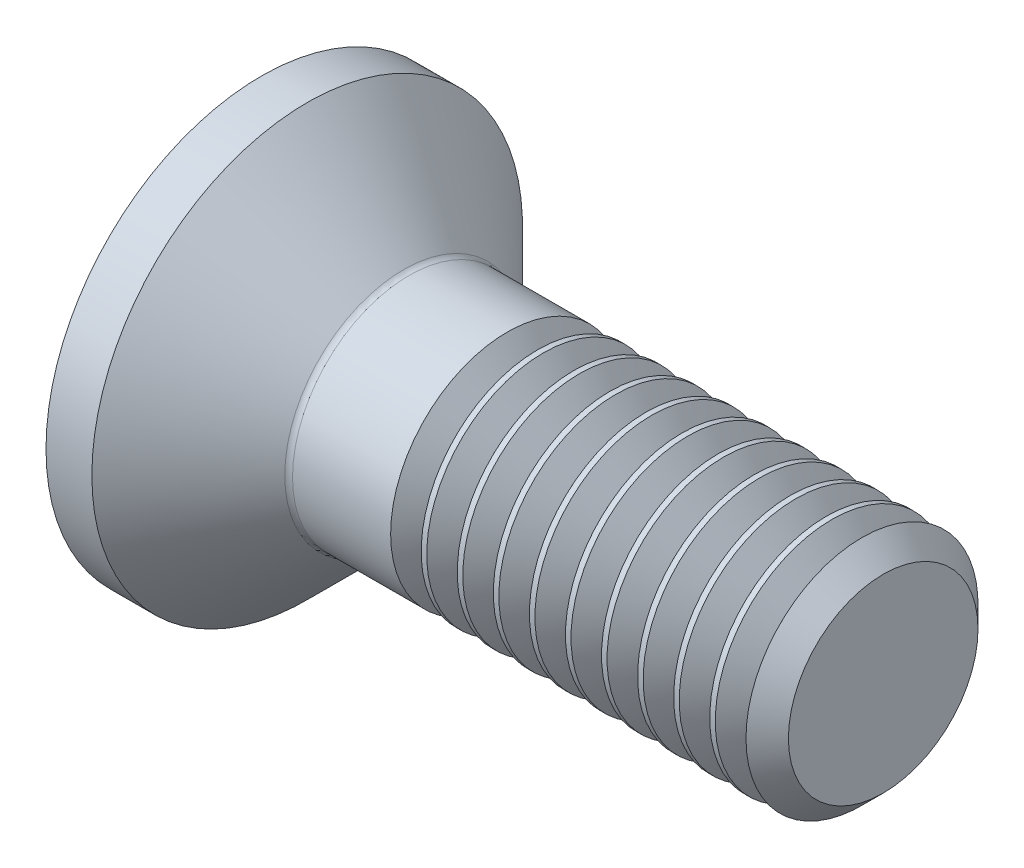
ISO-10303-21;
HEADER;
FILE_DESCRIPTION(('STEP AP214'),'2;1');
FILE_NAME('part.step','',(''),(''),'','','');
FILE_SCHEMA(('AUTOMOTIVE_DESIGN { 1 0 10303 214 1 1 1 1 }'));
ENDSEC;
DATA;
#1=APPLICATION_CONTEXT('core data for automotive mechanical design processes');
#2=APPLICATION_PROTOCOL_DEFINITION('international standard','automotive_design',2000,#1);
#3=PRODUCT_CONTEXT('',#1,'mechanical');
#4=PRODUCT('Part','Part','',(#3));
#5=PRODUCT_RELATED_PRODUCT_CATEGORY('part','',(#4));
#6=PRODUCT_DEFINITION_FORMATION('','',#4);
#7=PRODUCT_DEFINITION_CONTEXT('part definition',#1,'design');
#8=PRODUCT_DEFINITION('design','',#6,#7);
#9=PRODUCT_DEFINITION_SHAPE('','',#8);
#10=(LENGTH_UNIT() NAMED_UNIT(*) SI_UNIT(.MILLI.,.METRE.));
#11=(NAMED_UNIT(*) PLANE_ANGLE_UNIT() SI_UNIT($,.RADIAN.));
#12=(NAMED_UNIT(*) SI_UNIT($,.STERADIAN.) SOLID_ANGLE_UNIT());
#13=UNCERTAINTY_MEASURE_WITH_UNIT(LENGTH_MEASURE(1.E-05),#10,'distance_accuracy_value','');
#14=(GEOMETRIC_REPRESENTATION_CONTEXT(3) GLOBAL_UNCERTAINTY_ASSIGNED_CONTEXT((#13)) GLOBAL_UNIT_ASSIGNED_CONTEXT((#10,
#11,#12)) REPRESENTATION_CONTEXT('',''));
#15=CARTESIAN_POINT('',(0.,0.,0.));
#16=DIRECTION('',(0.,0.,1.));
#17=DIRECTION('',(1.,0.,0.));
#18=AXIS2_PLACEMENT_3D('',#15,#16,#17);
#19=CARTESIAN_POINT('',(0.,0.,0.));
#20=DIRECTION('',(-1.,0.,0.));
#21=DIRECTION('',(0.,0.,1.));
#22=AXIS2_PLACEMENT_3D('',#19,#20,#21);
#23=PLANE('',#22);
#24=CARTESIAN_POINT('',(0.,0.,0.));
#25=DIRECTION('',(-1.,0.,0.));
#26=DIRECTION('',(0.,0.,1.));
#27=AXIS2_PLACEMENT_3D('',#24,#25,#26);
#28=CIRCLE('',#27,2.77);
#29=CARTESIAN_POINT('',(0.,0.,2.77));
#30=VERTEX_POINT('',#29);
#31=EDGE_CURVE('E152',#30,#30,#28,.T.);
#32=ORIENTED_EDGE('',*,*,#31,.T.);
#33=EDGE_LOOP('',(#32));
#34=FACE_BOUND('',#33,.T.);
#35=DIRECTION('',(0.,-0.499999999999998,-0.86602540378444));
#36=VECTOR('',#35,1.);
#37=CARTESIAN_POINT('',(0.,-0.577350269189626,1.));
#38=LINE('',#37,#36);
#39=CARTESIAN_POINT('',(0.,-0.577350269189626,1.));
#40=VERTEX_POINT('',#39);
#41=CARTESIAN_POINT('',(0.,-1.15470053837925,0.));
#42=VERTEX_POINT('',#41);
#43=EDGE_CURVE('E121',#40,#42,#38,.T.);
#44=ORIENTED_EDGE('',*,*,#43,.T.);
#45=DIRECTION('',(0.,0.499999999999999,-0.866025403784439));
#46=VECTOR('',#45,1.);
#47=CARTESIAN_POINT('',(0.,-1.15470053837925,0.));
#48=LINE('',#47,#46);
#49=CARTESIAN_POINT('',(0.,-0.577350269189625,-1.));
#50=VERTEX_POINT('',#49);
#51=EDGE_CURVE('E52',#42,#50,#48,.T.);
#52=ORIENTED_EDGE('',*,*,#51,.T.);
#53=DIRECTION('',(0.,1.,0.));
#54=VECTOR('',#53,1.);
#55=CARTESIAN_POINT('',(0.,-0.577350269189625,-1.));
#56=LINE('',#55,#54);
#57=CARTESIAN_POINT('',(0.,0.577350269189626,-1.));
#58=VERTEX_POINT('',#57);
#59=EDGE_CURVE('E132',#50,#58,#56,.T.);
#60=ORIENTED_EDGE('',*,*,#59,.T.);
#61=DIRECTION('',(0.,0.5,0.866025403784439));
#62=VECTOR('',#61,1.);
#63=CARTESIAN_POINT('',(0.,0.577350269189626,-1.));
#64=LINE('',#63,#62);
#65=CARTESIAN_POINT('',(0.,1.15470053837925,0.));
#66=VERTEX_POINT('',#65);
#67=EDGE_CURVE('E417',#58,#66,#64,.T.);
#68=ORIENTED_EDGE('',*,*,#67,.T.);
#69=DIRECTION('',(0.,-0.499999999999999,0.866025403784439));
#70=VECTOR('',#69,1.);
#71=CARTESIAN_POINT('',(0.,1.15470053837925,0.));
#72=LINE('',#71,#70);
#73=CARTESIAN_POINT('',(0.,0.577350269189626,0.999999999999999));
#74=VERTEX_POINT('',#73);
#75=EDGE_CURVE('E420',#66,#74,#72,.T.);
#76=ORIENTED_EDGE('',*,*,#75,.T.);
#77=DIRECTION('',(0.,-1.,0.));
#78=VECTOR('',#77,1.);
#79=CARTESIAN_POINT('',(0.,0.577350269189626,0.999999999999999));
#80=LINE('',#79,#78);
#81=EDGE_CURVE('E423',#74,#40,#80,.T.);
#82=ORIENTED_EDGE('',*,*,#81,.T.);
#83=EDGE_LOOP('',(#44,#52,#60,#68,#76,#82));
#84=FACE_BOUND('',#83,.T.);
#85=ADVANCED_FACE('F36',(#34,#84),#23,.T.);
#86=CARTESIAN_POINT('',(0.,0.,0.));
#87=DIRECTION('',(-1.,0.,0.));
#88=DIRECTION('',(0.,0.,1.));
#89=AXIS2_PLACEMENT_3D('',#86,#87,#88);
#90=CYLINDRICAL_SURFACE('',#89,2.77);
#91=CARTESIAN_POINT('',(0.590000000000013,0.,0.));
#92=DIRECTION('',(-1.,0.,0.));
#93=DIRECTION('',(0.,0.,1.));
#94=AXIS2_PLACEMENT_3D('',#91,#92,#93);
#95=CIRCLE('',#94,2.77);
#96=CARTESIAN_POINT('',(0.590000000000013,0.,2.77));
#97=VERTEX_POINT('',#96);
#98=EDGE_CURVE('E149',#97,#97,#95,.T.);
#99=ORIENTED_EDGE('',*,*,#98,.T.);
#100=EDGE_LOOP('',(#99));
#101=FACE_BOUND('',#100,.T.);
#102=ORIENTED_EDGE('',*,*,#31,.F.);
#103=EDGE_LOOP('',(#102));
#104=FACE_BOUND('',#103,.T.);
#105=ADVANCED_FACE('F175',(#101,#104),#90,.T.);
#106=CARTESIAN_POINT('',(0.590000000000013,0.,0.));
#107=DIRECTION('',(-1.,0.,0.));
#108=DIRECTION('',(0.,0.,1.));
#109=AXIS2_PLACEMENT_3D('',#106,#107,#108);
#110=CONICAL_SURFACE('',#109,2.77,0.785398163397451);
#111=CARTESIAN_POINT('',(1.83071067811866,0.,0.));
#112=DIRECTION('',(-1.,0.,0.));
#113=DIRECTION('',(0.,0.,1.));
#114=AXIS2_PLACEMENT_3D('',#111,#112,#113);
#115=CIRCLE('',#114,1.52928932188135);
#116=CARTESIAN_POINT('',(1.83071067811866,0.,1.52928932188135));
#117=VERTEX_POINT('',#116);
#118=EDGE_CURVE('E45',#117,#117,#115,.T.);
#119=ORIENTED_EDGE('',*,*,#118,.T.);
#120=EDGE_LOOP('',(#119));
#121=FACE_BOUND('',#120,.T.);
#122=ORIENTED_EDGE('',*,*,#98,.F.);
#123=EDGE_LOOP('',(#122));
#124=FACE_BOUND('',#123,.T.);
#125=ADVANCED_FACE('F158',(#121,#124),#110,.T.);
#126=CARTESIAN_POINT('',(0.,0.,0.));
#127=DIRECTION('',(-1.,0.,0.));
#128=DIRECTION('',(0.,0.,1.));
#129=AXIS2_PLACEMENT_3D('',#126,#127,#128);
#130=CYLINDRICAL_SURFACE('',#129,1.5);
#131=CARTESIAN_POINT('',(3.16359278553217,0.,0.));
#132=DIRECTION('',(-1.,0.,0.));
#133=DIRECTION('',(0.,-1.,0.));
#134=AXIS2_PLACEMENT_3D('',#131,#132,#133);
#135=CIRCLE('',#134,1.5);
#136=CARTESIAN_POINT('',(3.16359278553217,-1.5,0.));
#137=VERTEX_POINT('',#136);
#138=EDGE_CURVE('E393',#137,#137,#135,.T.);
#139=ORIENTED_EDGE('',*,*,#138,.T.);
#140=EDGE_LOOP('',(#139));
#141=FACE_BOUND('',#140,.T.);
#142=CARTESIAN_POINT('',(1.90142135623731,0.,0.));
#143=DIRECTION('',(-1.,0.,0.));
#144=DIRECTION('',(0.,0.,1.));
#145=AXIS2_PLACEMENT_3D('',#142,#143,#144);
#146=CIRCLE('',#145,1.5);
#147=CARTESIAN_POINT('',(1.90142135623731,0.,1.5));
#148=VERTEX_POINT('',#147);
#149=EDGE_CURVE('E11',#148,#148,#146,.F.);
#150=ORIENTED_EDGE('',*,*,#149,.T.);
#151=EDGE_LOOP('',(#150));
#152=FACE_BOUND('',#151,.T.);
#153=ADVANCED_FACE('F162',(#141,#152),#130,.T.);
#154=CARTESIAN_POINT('',(1.90142135623731,0.,0.));
#155=DIRECTION('',(-1.,0.,0.));
#156=DIRECTION('',(0.,0.,1.));
#157=AXIS2_PLACEMENT_3D('',#154,#155,#156);
#158=TOROIDAL_SURFACE('',#157,1.6,0.1);
#159=ORIENTED_EDGE('',*,*,#149,.F.);
#160=EDGE_LOOP('',(#159));
#161=FACE_BOUND('',#160,.T.);
#162=ORIENTED_EDGE('',*,*,#118,.F.);
#163=EDGE_LOOP('',(#162));
#164=FACE_BOUND('',#163,.T.);
#165=ADVANCED_FACE('F38',(#161,#164),#158,.F.);
#166=CARTESIAN_POINT('',(1.1,-1.15470053837925,0.));
#167=DIRECTION('',(0.,0.866025403784439,0.499999999999999));
#168=DIRECTION('',(0.,-0.499999999999999,0.866025403784439));
#169=AXIS2_PLACEMENT_3D('',#166,#167,#168);
#170=PLANE('',#169);
#171=ORIENTED_EDGE('',*,*,#51,.F.);
#172=DIRECTION('',(-1.,0.,0.));
#173=VECTOR('',#172,1.);
#174=CARTESIAN_POINT('',(1.1,-1.15470053837925,0.));
#175=LINE('',#174,#173);
#176=CARTESIAN_POINT('',(1.1,-1.15470053837925,0.));
#177=VERTEX_POINT('',#176);
#178=EDGE_CURVE('E414',#177,#42,#175,.T.);
#179=ORIENTED_EDGE('',*,*,#178,.F.);
#180=DIRECTION('',(0.,0.499999999999999,-0.866025403784439));
#181=VECTOR('',#180,1.);
#182=CARTESIAN_POINT('',(1.1,-1.15470053837925,0.));
#183=LINE('',#182,#181);
#184=CARTESIAN_POINT('',(1.1,-0.866025403784438,-0.499999999999998));
#185=VERTEX_POINT('',#184);
#186=EDGE_CURVE('E117',#177,#185,#183,.T.);
#187=ORIENTED_EDGE('',*,*,#186,.T.);
#188=CARTESIAN_POINT('',(1.1,-0.577350269189625,-1.));
#189=VERTEX_POINT('',#188);
#190=EDGE_CURVE('E113',#185,#189,#183,.T.);
#191=ORIENTED_EDGE('',*,*,#190,.T.);
#192=DIRECTION('',(-1.,0.,0.));
#193=VECTOR('',#192,1.);
#194=CARTESIAN_POINT('',(1.1,-0.577350269189625,-1.));
#195=LINE('',#194,#193);
#196=EDGE_CURVE('E115',#189,#50,#195,.T.);
#197=ORIENTED_EDGE('',*,*,#196,.T.);
#198=EDGE_LOOP('',(#171,#179,#187,#191,#197));
#199=FACE_BOUND('',#198,.T.);
#200=ADVANCED_FACE('F114',(#199),#170,.T.);
#201=CARTESIAN_POINT('',(1.1,-0.577350269189625,-1.));
#202=DIRECTION('',(0.,0.,1.));
#203=DIRECTION('',(1.,0.,0.));
#204=AXIS2_PLACEMENT_3D('',#201,#202,#203);
#205=PLANE('',#204);
#206=ORIENTED_EDGE('',*,*,#59,.F.);
#207=ORIENTED_EDGE('',*,*,#196,.F.);
#208=DIRECTION('',(0.,1.,0.));
#209=VECTOR('',#208,1.);
#210=CARTESIAN_POINT('',(1.1,-0.577350269189625,-1.));
#211=LINE('',#210,#209);
#212=CARTESIAN_POINT('',(1.1,0.,-1.));
#213=VERTEX_POINT('',#212);
#214=EDGE_CURVE('E60',#189,#213,#211,.T.);
#215=ORIENTED_EDGE('',*,*,#214,.T.);
#216=CARTESIAN_POINT('',(1.1,0.577350269189626,-1.));
#217=VERTEX_POINT('',#216);
#218=EDGE_CURVE('E127',#213,#217,#211,.T.);
#219=ORIENTED_EDGE('',*,*,#218,.T.);
#220=DIRECTION('',(-1.,0.,0.));
#221=VECTOR('',#220,1.);
#222=CARTESIAN_POINT('',(1.1,0.577350269189626,-1.));
#223=LINE('',#222,#221);
#224=EDGE_CURVE('E134',#217,#58,#223,.T.);
#225=ORIENTED_EDGE('',*,*,#224,.T.);
#226=EDGE_LOOP('',(#206,#207,#215,#219,#225));
#227=FACE_BOUND('',#226,.T.);
#228=ADVANCED_FACE('F129',(#227),#205,.T.);
#229=CARTESIAN_POINT('',(1.1,0.577350269189626,-1.));
#230=DIRECTION('',(0.,-0.866025403784438,0.5));
#231=DIRECTION('',(0.,-0.5,-0.866025403784439));
#232=AXIS2_PLACEMENT_3D('',#229,#230,#231);
#233=PLANE('',#232);
#234=ORIENTED_EDGE('',*,*,#67,.F.);
#235=ORIENTED_EDGE('',*,*,#224,.F.);
#236=DIRECTION('',(0.,0.5,0.866025403784439));
#237=VECTOR('',#236,1.);
#238=CARTESIAN_POINT('',(1.1,0.577350269189626,-1.));
#239=LINE('',#238,#237);
#240=CARTESIAN_POINT('',(1.1,0.866025403784439,-0.5));
#241=VERTEX_POINT('',#240);
#242=EDGE_CURVE('E399',#217,#241,#239,.T.);
#243=ORIENTED_EDGE('',*,*,#242,.T.);
#244=CARTESIAN_POINT('',(1.1,1.15470053837925,0.));
#245=VERTEX_POINT('',#244);
#246=EDGE_CURVE('E126',#241,#245,#239,.T.);
#247=ORIENTED_EDGE('',*,*,#246,.T.);
#248=DIRECTION('',(-1.,0.,0.));
#249=VECTOR('',#248,1.);
#250=CARTESIAN_POINT('',(1.1,1.15470053837925,0.));
#251=LINE('',#250,#249);
#252=EDGE_CURVE('E140',#245,#66,#251,.T.);
#253=ORIENTED_EDGE('',*,*,#252,.T.);
#254=EDGE_LOOP('',(#234,#235,#243,#247,#253));
#255=FACE_BOUND('',#254,.T.);
#256=ADVANCED_FACE('F203',(#255),#233,.T.);
#257=CARTESIAN_POINT('',(1.1,1.15470053837925,0.));
#258=DIRECTION('',(0.,-0.866025403784439,-0.499999999999999));
#259=DIRECTION('',(0.,0.499999999999999,-0.866025403784439));
#260=AXIS2_PLACEMENT_3D('',#257,#258,#259);
#261=PLANE('',#260);
#262=ORIENTED_EDGE('',*,*,#75,.F.);
#263=ORIENTED_EDGE('',*,*,#252,.F.);
#264=DIRECTION('',(0.,-0.499999999999999,0.866025403784439));
#265=VECTOR('',#264,1.);
#266=CARTESIAN_POINT('',(1.1,1.15470053837925,0.));
#267=LINE('',#266,#265);
#268=CARTESIAN_POINT('',(1.1,0.866025403784438,0.499999999999999));
#269=VERTEX_POINT('',#268);
#270=EDGE_CURVE('E403',#245,#269,#267,.T.);
#271=ORIENTED_EDGE('',*,*,#270,.T.);
#272=CARTESIAN_POINT('',(1.1,0.577350269189626,0.999999999999999));
#273=VERTEX_POINT('',#272);
#274=EDGE_CURVE('E402',#269,#273,#267,.T.);
#275=ORIENTED_EDGE('',*,*,#274,.T.);
#276=DIRECTION('',(-1.,0.,0.));
#277=VECTOR('',#276,1.);
#278=CARTESIAN_POINT('',(1.1,0.577350269189626,0.999999999999999));
#279=LINE('',#278,#277);
#280=EDGE_CURVE('E432',#273,#74,#279,.T.);
#281=ORIENTED_EDGE('',*,*,#280,.T.);
#282=EDGE_LOOP('',(#262,#263,#271,#275,#281));
#283=FACE_BOUND('',#282,.T.);
#284=ADVANCED_FACE('F206',(#283),#261,.T.);
#285=CARTESIAN_POINT('',(1.1,0.577350269189626,0.999999999999999));
#286=DIRECTION('',(0.,0.,-1.));
#287=DIRECTION('',(0.,1.,0.));
#288=AXIS2_PLACEMENT_3D('',#285,#286,#287);
#289=PLANE('',#288);
#290=ORIENTED_EDGE('',*,*,#81,.F.);
#291=ORIENTED_EDGE('',*,*,#280,.F.);
#292=DIRECTION('',(0.,-1.,0.));
#293=VECTOR('',#292,1.);
#294=CARTESIAN_POINT('',(1.1,0.577350269189626,0.999999999999999));
#295=LINE('',#294,#293);
#296=CARTESIAN_POINT('',(1.1,0.,1.));
#297=VERTEX_POINT('',#296);
#298=EDGE_CURVE('E407',#273,#297,#295,.T.);
#299=ORIENTED_EDGE('',*,*,#298,.T.);
#300=CARTESIAN_POINT('',(1.1,-0.577350269189626,1.));
#301=VERTEX_POINT('',#300);
#302=EDGE_CURVE('E406',#297,#301,#295,.T.);
#303=ORIENTED_EDGE('',*,*,#302,.T.);
#304=DIRECTION('',(-1.,0.,0.));
#305=VECTOR('',#304,1.);
#306=CARTESIAN_POINT('',(1.1,-0.577350269189626,1.));
#307=LINE('',#306,#305);
#308=EDGE_CURVE('E429',#301,#40,#307,.T.);
#309=ORIENTED_EDGE('',*,*,#308,.T.);
#310=EDGE_LOOP('',(#290,#291,#299,#303,#309));
#311=FACE_BOUND('',#310,.T.);
#312=ADVANCED_FACE('F210',(#311),#289,.T.);
#313=CARTESIAN_POINT('',(1.1,-0.577350269189626,1.));
#314=DIRECTION('',(0.,0.86602540378444,-0.499999999999998));
#315=DIRECTION('',(0.,0.499999999999998,0.86602540378444));
#316=AXIS2_PLACEMENT_3D('',#313,#314,#315);
#317=PLANE('',#316);
#318=ORIENTED_EDGE('',*,*,#43,.F.);
#319=ORIENTED_EDGE('',*,*,#308,.F.);
#320=DIRECTION('',(0.,-0.499999999999998,-0.86602540378444));
#321=VECTOR('',#320,1.);
#322=CARTESIAN_POINT('',(1.1,-0.577350269189626,1.));
#323=LINE('',#322,#321);
#324=CARTESIAN_POINT('',(1.1,-0.866025403784439,0.499999999999997));
#325=VERTEX_POINT('',#324);
#326=EDGE_CURVE('E411',#301,#325,#323,.T.);
#327=ORIENTED_EDGE('',*,*,#326,.T.);
#328=EDGE_CURVE('E410',#325,#177,#323,.T.);
#329=ORIENTED_EDGE('',*,*,#328,.T.);
#330=ORIENTED_EDGE('',*,*,#178,.T.);
#331=EDGE_LOOP('',(#318,#319,#327,#329,#330));
#332=FACE_BOUND('',#331,.T.);
#333=ADVANCED_FACE('F214',(#332),#317,.T.);
#334=CARTESIAN_POINT('',(1.1,-0.577350269189626,-1.));
#335=DIRECTION('',(1.,0.,0.));
#336=DIRECTION('',(0.,0.,-1.));
#337=AXIS2_PLACEMENT_3D('',#334,#335,#336);
#338=PLANE('',#337);
#339=ORIENTED_EDGE('',*,*,#214,.F.);
#340=ORIENTED_EDGE('',*,*,#190,.F.);
#341=CARTESIAN_POINT('',(1.1,0.,0.));
#342=DIRECTION('',(-1.,0.,0.));
#343=DIRECTION('',(0.,0.,1.));
#344=AXIS2_PLACEMENT_3D('',#341,#342,#343);
#345=CIRCLE('',#344,1.);
#346=EDGE_CURVE('E124',#213,#185,#345,.T.);
#347=ORIENTED_EDGE('',*,*,#346,.F.);
#348=EDGE_LOOP('',(#339,#340,#347));
#349=FACE_BOUND('',#348,.T.);
#350=ADVANCED_FACE('F123',(#349),#338,.F.);
#351=ORIENTED_EDGE('',*,*,#186,.F.);
#352=ORIENTED_EDGE('',*,*,#328,.F.);
#353=EDGE_CURVE('E137',#185,#325,#345,.T.);
#354=ORIENTED_EDGE('',*,*,#353,.F.);
#355=EDGE_LOOP('',(#351,#352,#354));
#356=FACE_BOUND('',#355,.T.);
#357=ADVANCED_FACE('F221',(#356),#338,.F.);
#358=ORIENTED_EDGE('',*,*,#326,.F.);
#359=ORIENTED_EDGE('',*,*,#302,.F.);
#360=EDGE_CURVE('E133',#325,#297,#345,.T.);
#361=ORIENTED_EDGE('',*,*,#360,.F.);
#362=EDGE_LOOP('',(#358,#359,#361));
#363=FACE_BOUND('',#362,.T.);
#364=ADVANCED_FACE('F445',(#363),#338,.F.);
#365=ORIENTED_EDGE('',*,*,#298,.F.);
#366=ORIENTED_EDGE('',*,*,#274,.F.);
#367=EDGE_CURVE('E139',#297,#269,#345,.T.);
#368=ORIENTED_EDGE('',*,*,#367,.F.);
#369=EDGE_LOOP('',(#365,#366,#368));
#370=FACE_BOUND('',#369,.T.);
#371=ADVANCED_FACE('F456',(#370),#338,.F.);
#372=ORIENTED_EDGE('',*,*,#270,.F.);
#373=ORIENTED_EDGE('',*,*,#246,.F.);
#374=EDGE_CURVE('E146',#269,#241,#345,.T.);
#375=ORIENTED_EDGE('',*,*,#374,.F.);
#376=EDGE_LOOP('',(#372,#373,#375));
#377=FACE_BOUND('',#376,.T.);
#378=ADVANCED_FACE('F454',(#377),#338,.F.);
#379=ORIENTED_EDGE('',*,*,#242,.F.);
#380=ORIENTED_EDGE('',*,*,#218,.F.);
#381=EDGE_CURVE('E450',#241,#213,#345,.T.);
#382=ORIENTED_EDGE('',*,*,#381,.F.);
#383=EDGE_LOOP('',(#379,#380,#382));
#384=FACE_BOUND('',#383,.T.);
#385=ADVANCED_FACE('F198',(#384),#338,.F.);
#386=CARTESIAN_POINT('',(1.1,0.,0.));
#387=DIRECTION('',(-1.,0.,0.));
#388=DIRECTION('',(0.,0.,1.));
#389=AXIS2_PLACEMENT_3D('',#386,#387,#388);
#390=CONICAL_SURFACE('',#389,1.,1.04719755119659);
#391=CARTESIAN_POINT('',(1.67735026918963,0.,0.));
#392=VERTEX_POINT('',#391);
#393=VERTEX_LOOP('',#392);
#394=FACE_BOUND('',#393,.T.);
#395=ORIENTED_EDGE('',*,*,#367,.T.);
#396=ORIENTED_EDGE('',*,*,#374,.T.);
#397=ORIENTED_EDGE('',*,*,#381,.T.);
#398=ORIENTED_EDGE('',*,*,#346,.T.);
#399=ORIENTED_EDGE('',*,*,#353,.T.);
#400=ORIENTED_EDGE('',*,*,#360,.T.);
#401=EDGE_LOOP('',(#395,#396,#397,#398,#399,#400));
#402=FACE_BOUND('',#401,.T.);
#403=ADVANCED_FACE('F195',(#394,#402),#390,.F.);
#404=CARTESIAN_POINT('',(3.55640921446782,0.,0.));
#405=DIRECTION('',(1.,0.,0.));
#406=DIRECTION('',(0.,1.,0.));
#407=AXIS2_PLACEMENT_3D('',#404,#405,#406);
#408=CONICAL_SURFACE('',#407,1.5,0.959931088596882);
#409=CARTESIAN_POINT('',(3.360001,0.,0.));
#410=DIRECTION('',(-1.,0.,0.));
#411=DIRECTION('',(0.,-1.,0.));
#412=AXIS2_PLACEMENT_3D('',#409,#410,#411);
#413=CIRCLE('',#412,1.2195);
#414=CARTESIAN_POINT('',(3.360001,-1.2195,0.));
#415=VERTEX_POINT('',#414);
#416=EDGE_CURVE('E390',#415,#415,#413,.T.);
#417=ORIENTED_EDGE('',*,*,#416,.F.);
#418=EDGE_LOOP('',(#417));
#419=FACE_BOUND('',#418,.T.);
#420=CARTESIAN_POINT('',(3.55640921446782,0.,0.));
#421=DIRECTION('',(-1.,0.,0.));
#422=DIRECTION('',(0.,-1.,0.));
#423=AXIS2_PLACEMENT_3D('',#420,#421,#422);
#424=CIRCLE('',#423,1.5);
#425=CARTESIAN_POINT('',(3.55640921446782,-1.5,0.));
#426=VERTEX_POINT('',#425);
#427=EDGE_CURVE('E396',#426,#426,#424,.T.);
#428=ORIENTED_EDGE('',*,*,#427,.T.);
#429=EDGE_LOOP('',(#428));
#430=FACE_BOUND('',#429,.T.);
#431=ADVANCED_FACE('F197',(#419,#430),#408,.T.);
#432=CARTESIAN_POINT('',(3.360001,0.,0.));
#433=DIRECTION('',(-1.,0.,0.));
#434=DIRECTION('',(0.,-1.,0.));
#435=AXIS2_PLACEMENT_3D('',#432,#433,#434);
#436=CONICAL_SURFACE('',#435,1.2195,0.959931088596878);
#437=ORIENTED_EDGE('',*,*,#138,.F.);
#438=EDGE_LOOP('',(#437));
#439=FACE_BOUND('',#438,.T.);
#440=ORIENTED_EDGE('',*,*,#416,.T.);
#441=EDGE_LOOP('',(#440));
#442=FACE_BOUND('',#441,.T.);
#443=ADVANCED_FACE('F224',(#439,#442),#436,.T.);
#444=CARTESIAN_POINT('',(3.62759278553217,0.,0.));
#445=DIRECTION('',(-1.,0.,0.));
#446=DIRECTION('',(0.,-1.,0.));
#447=AXIS2_PLACEMENT_3D('',#444,#445,#446);
#448=CIRCLE('',#447,1.5);
#449=CARTESIAN_POINT('',(3.62759278553217,-1.5,0.));
#450=VERTEX_POINT('',#449);
#451=EDGE_CURVE('E384',#450,#450,#448,.T.);
#452=ORIENTED_EDGE('',*,*,#451,.T.);
#453=EDGE_LOOP('',(#452));
#454=FACE_BOUND('',#453,.T.);
#455=ORIENTED_EDGE('',*,*,#427,.F.);
#456=EDGE_LOOP('',(#455));
#457=FACE_BOUND('',#456,.T.);
#458=ADVANCED_FACE('F172',(#454,#457),#130,.T.);
#459=CARTESIAN_POINT('',(4.02040921446782,0.,0.));
#460=DIRECTION('',(1.,0.,0.));
#461=DIRECTION('',(0.,1.,0.));
#462=AXIS2_PLACEMENT_3D('',#459,#460,#461);
#463=CONICAL_SURFACE('',#462,1.5,0.959931088596882);
#464=CARTESIAN_POINT('',(3.824001,0.,0.));
#465=DIRECTION('',(-1.,0.,0.));
#466=DIRECTION('',(0.,-1.,0.));
#467=AXIS2_PLACEMENT_3D('',#464,#465,#466);
#468=CIRCLE('',#467,1.2195);
#469=CARTESIAN_POINT('',(3.824001,-1.2195,0.));
#470=VERTEX_POINT('',#469);
#471=EDGE_CURVE('E381',#470,#470,#468,.T.);
#472=ORIENTED_EDGE('',*,*,#471,.F.);
#473=EDGE_LOOP('',(#472));
#474=FACE_BOUND('',#473,.T.);
#475=CARTESIAN_POINT('',(4.02040921446782,0.,0.));
#476=DIRECTION('',(-1.,0.,0.));
#477=DIRECTION('',(0.,-1.,0.));
#478=AXIS2_PLACEMENT_3D('',#475,#476,#477);
#479=CIRCLE('',#478,1.5);
#480=CARTESIAN_POINT('',(4.02040921446782,-1.5,0.));
#481=VERTEX_POINT('',#480);
#482=EDGE_CURVE('E387',#481,#481,#479,.T.);
#483=ORIENTED_EDGE('',*,*,#482,.T.);
#484=EDGE_LOOP('',(#483));
#485=FACE_BOUND('',#484,.T.);
#486=ADVANCED_FACE('F229',(#474,#485),#463,.T.);
#487=CARTESIAN_POINT('',(3.824001,0.,0.));
#488=DIRECTION('',(-1.,0.,0.));
#489=DIRECTION('',(0.,-1.,0.));
#490=AXIS2_PLACEMENT_3D('',#487,#488,#489);
#491=CONICAL_SURFACE('',#490,1.2195,0.959931088596878);
#492=ORIENTED_EDGE('',*,*,#451,.F.);
#493=EDGE_LOOP('',(#492));
#494=FACE_BOUND('',#493,.T.);
#495=ORIENTED_EDGE('',*,*,#471,.T.);
#496=EDGE_LOOP('',(#495));
#497=FACE_BOUND('',#496,.T.);
#498=ADVANCED_FACE('F232',(#494,#497),#491,.T.);
#499=CARTESIAN_POINT('',(4.09159278553217,0.,0.));
#500=DIRECTION('',(-1.,0.,0.));
#501=DIRECTION('',(0.,-1.,0.));
#502=AXIS2_PLACEMENT_3D('',#499,#500,#501);
#503=CIRCLE('',#502,1.5);
#504=CARTESIAN_POINT('',(4.09159278553217,-1.5,0.));
#505=VERTEX_POINT('',#504);
#506=EDGE_CURVE('E375',#505,#505,#503,.T.);
#507=ORIENTED_EDGE('',*,*,#506,.T.);
#508=EDGE_LOOP('',(#507));
#509=FACE_BOUND('',#508,.T.);
#510=ORIENTED_EDGE('',*,*,#482,.F.);
#511=EDGE_LOOP('',(#510));
#512=FACE_BOUND('',#511,.T.);
#513=ADVANCED_FACE('F236',(#509,#512),#130,.T.);
#514=CARTESIAN_POINT('',(4.48440921446782,0.,0.));
#515=DIRECTION('',(1.,0.,0.));
#516=DIRECTION('',(0.,1.,0.));
#517=AXIS2_PLACEMENT_3D('',#514,#515,#516);
#518=CONICAL_SURFACE('',#517,1.5,0.959931088596882);
#519=CARTESIAN_POINT('',(4.288001,0.,0.));
#520=DIRECTION('',(-1.,0.,0.));
#521=DIRECTION('',(0.,-1.,0.));
#522=AXIS2_PLACEMENT_3D('',#519,#520,#521);
#523=CIRCLE('',#522,1.2195);
#524=CARTESIAN_POINT('',(4.288001,-1.2195,0.));
#525=VERTEX_POINT('',#524);
#526=EDGE_CURVE('E372',#525,#525,#523,.T.);
#527=ORIENTED_EDGE('',*,*,#526,.F.);
#528=EDGE_LOOP('',(#527));
#529=FACE_BOUND('',#528,.T.);
#530=CARTESIAN_POINT('',(4.48440921446782,0.,0.));
#531=DIRECTION('',(-1.,0.,0.));
#532=DIRECTION('',(0.,-1.,0.));
#533=AXIS2_PLACEMENT_3D('',#530,#531,#532);
#534=CIRCLE('',#533,1.5);
#535=CARTESIAN_POINT('',(4.48440921446782,-1.5,0.));
#536=VERTEX_POINT('',#535);
#537=EDGE_CURVE('E378',#536,#536,#534,.T.);
#538=ORIENTED_EDGE('',*,*,#537,.T.);
#539=EDGE_LOOP('',(#538));
#540=FACE_BOUND('',#539,.T.);
#541=ADVANCED_FACE('F238',(#529,#540),#518,.T.);
#542=CARTESIAN_POINT('',(4.288001,0.,0.));
#543=DIRECTION('',(-1.,0.,0.));
#544=DIRECTION('',(0.,-1.,0.));
#545=AXIS2_PLACEMENT_3D('',#542,#543,#544);
#546=CONICAL_SURFACE('',#545,1.2195,0.959931088596878);
#547=ORIENTED_EDGE('',*,*,#506,.F.);
#548=EDGE_LOOP('',(#547));
#549=FACE_BOUND('',#548,.T.);
#550=ORIENTED_EDGE('',*,*,#526,.T.);
#551=EDGE_LOOP('',(#550));
#552=FACE_BOUND('',#551,.T.);
#553=ADVANCED_FACE('F241',(#549,#552),#546,.T.);
#554=CARTESIAN_POINT('',(4.55559278553217,0.,0.));
#555=DIRECTION('',(-1.,0.,0.));
#556=DIRECTION('',(0.,-1.,0.));
#557=AXIS2_PLACEMENT_3D('',#554,#555,#556);
#558=CIRCLE('',#557,1.5);
#559=CARTESIAN_POINT('',(4.55559278553217,-1.5,0.));
#560=VERTEX_POINT('',#559);
#561=EDGE_CURVE('E366',#560,#560,#558,.T.);
#562=ORIENTED_EDGE('',*,*,#561,.T.);
#563=EDGE_LOOP('',(#562));
#564=FACE_BOUND('',#563,.T.);
#565=ORIENTED_EDGE('',*,*,#537,.F.);
#566=EDGE_LOOP('',(#565));
#567=FACE_BOUND('',#566,.T.);
#568=ADVANCED_FACE('F245',(#564,#567),#130,.T.);
#569=CARTESIAN_POINT('',(4.94840921446782,0.,0.));
#570=DIRECTION('',(1.,0.,0.));
#571=DIRECTION('',(0.,1.,0.));
#572=AXIS2_PLACEMENT_3D('',#569,#570,#571);
#573=CONICAL_SURFACE('',#572,1.5,0.959931088596882);
#574=CARTESIAN_POINT('',(4.752001,0.,0.));
#575=DIRECTION('',(-1.,0.,0.));
#576=DIRECTION('',(0.,-1.,0.));
#577=AXIS2_PLACEMENT_3D('',#574,#575,#576);
#578=CIRCLE('',#577,1.2195);
#579=CARTESIAN_POINT('',(4.752001,-1.2195,0.));
#580=VERTEX_POINT('',#579);
#581=EDGE_CURVE('E363',#580,#580,#578,.T.);
#582=ORIENTED_EDGE('',*,*,#581,.F.);
#583=EDGE_LOOP('',(#582));
#584=FACE_BOUND('',#583,.T.);
#585=CARTESIAN_POINT('',(4.94840921446782,0.,0.));
#586=DIRECTION('',(-1.,0.,0.));
#587=DIRECTION('',(0.,-1.,0.));
#588=AXIS2_PLACEMENT_3D('',#585,#586,#587);
#589=CIRCLE('',#588,1.5);
#590=CARTESIAN_POINT('',(4.94840921446782,-1.5,0.));
#591=VERTEX_POINT('',#590);
#592=EDGE_CURVE('E369',#591,#591,#589,.T.);
#593=ORIENTED_EDGE('',*,*,#592,.T.);
#594=EDGE_LOOP('',(#593));
#595=FACE_BOUND('',#594,.T.);
#596=ADVANCED_FACE('F247',(#584,#595),#573,.T.);
#597=CARTESIAN_POINT('',(4.752001,0.,0.));
#598=DIRECTION('',(-1.,0.,0.));
#599=DIRECTION('',(0.,-1.,0.));
#600=AXIS2_PLACEMENT_3D('',#597,#598,#599);
#601=CONICAL_SURFACE('',#600,1.2195,0.959931088596878);
#602=ORIENTED_EDGE('',*,*,#561,.F.);
#603=EDGE_LOOP('',(#602));
#604=FACE_BOUND('',#603,.T.);
#605=ORIENTED_EDGE('',*,*,#581,.T.);
#606=EDGE_LOOP('',(#605));
#607=FACE_BOUND('',#606,.T.);
#608=ADVANCED_FACE('F250',(#604,#607),#601,.T.);
#609=CARTESIAN_POINT('',(5.01959278553217,0.,0.));
#610=DIRECTION('',(-1.,0.,0.));
#611=DIRECTION('',(0.,-1.,0.));
#612=AXIS2_PLACEMENT_3D('',#609,#610,#611);
#613=CIRCLE('',#612,1.5);
#614=CARTESIAN_POINT('',(5.01959278553217,-1.5,0.));
#615=VERTEX_POINT('',#614);
#616=EDGE_CURVE('E357',#615,#615,#613,.T.);
#617=ORIENTED_EDGE('',*,*,#616,.T.);
#618=EDGE_LOOP('',(#617));
#619=FACE_BOUND('',#618,.T.);
#620=ORIENTED_EDGE('',*,*,#592,.F.);
#621=EDGE_LOOP('',(#620));
#622=FACE_BOUND('',#621,.T.);
#623=ADVANCED_FACE('F254',(#619,#622),#130,.T.);
#624=CARTESIAN_POINT('',(5.41240921446782,0.,0.));
#625=DIRECTION('',(1.,0.,0.));
#626=DIRECTION('',(0.,1.,0.));
#627=AXIS2_PLACEMENT_3D('',#624,#625,#626);
#628=CONICAL_SURFACE('',#627,1.5,0.959931088596882);
#629=CARTESIAN_POINT('',(5.216001,0.,0.));
#630=DIRECTION('',(-1.,0.,0.));
#631=DIRECTION('',(0.,-1.,0.));
#632=AXIS2_PLACEMENT_3D('',#629,#630,#631);
#633=CIRCLE('',#632,1.2195);
#634=CARTESIAN_POINT('',(5.216001,-1.2195,0.));
#635=VERTEX_POINT('',#634);
#636=EDGE_CURVE('E354',#635,#635,#633,.T.);
#637=ORIENTED_EDGE('',*,*,#636,.F.);
#638=EDGE_LOOP('',(#637));
#639=FACE_BOUND('',#638,.T.);
#640=CARTESIAN_POINT('',(5.41240921446782,0.,0.));
#641=DIRECTION('',(-1.,0.,0.));
#642=DIRECTION('',(0.,-1.,0.));
#643=AXIS2_PLACEMENT_3D('',#640,#641,#642);
#644=CIRCLE('',#643,1.5);
#645=CARTESIAN_POINT('',(5.41240921446782,-1.5,0.));
#646=VERTEX_POINT('',#645);
#647=EDGE_CURVE('E360',#646,#646,#644,.T.);
#648=ORIENTED_EDGE('',*,*,#647,.T.);
#649=EDGE_LOOP('',(#648));
#650=FACE_BOUND('',#649,.T.);
#651=ADVANCED_FACE('F256',(#639,#650),#628,.T.);
#652=CARTESIAN_POINT('',(5.216001,0.,0.));
#653=DIRECTION('',(-1.,0.,0.));
#654=DIRECTION('',(0.,-1.,0.));
#655=AXIS2_PLACEMENT_3D('',#652,#653,#654);
#656=CONICAL_SURFACE('',#655,1.2195,0.959931088596878);
#657=ORIENTED_EDGE('',*,*,#616,.F.);
#658=EDGE_LOOP('',(#657));
#659=FACE_BOUND('',#658,.T.);
#660=ORIENTED_EDGE('',*,*,#636,.T.);
#661=EDGE_LOOP('',(#660));
#662=FACE_BOUND('',#661,.T.);
#663=ADVANCED_FACE('F259',(#659,#662),#656,.T.);
#664=CARTESIAN_POINT('',(5.48359278553217,0.,0.));
#665=DIRECTION('',(-1.,0.,0.));
#666=DIRECTION('',(0.,-1.,0.));
#667=AXIS2_PLACEMENT_3D('',#664,#665,#666);
#668=CIRCLE('',#667,1.5);
#669=CARTESIAN_POINT('',(5.48359278553217,-1.5,0.));
#670=VERTEX_POINT('',#669);
#671=EDGE_CURVE('E348',#670,#670,#668,.T.);
#672=ORIENTED_EDGE('',*,*,#671,.T.);
#673=EDGE_LOOP('',(#672));
#674=FACE_BOUND('',#673,.T.);
#675=ORIENTED_EDGE('',*,*,#647,.F.);
#676=EDGE_LOOP('',(#675));
#677=FACE_BOUND('',#676,.T.);
#678=ADVANCED_FACE('F263',(#674,#677),#130,.T.);
#679=CARTESIAN_POINT('',(5.87640921446782,0.,0.));
#680=DIRECTION('',(1.,0.,0.));
#681=DIRECTION('',(0.,1.,0.));
#682=AXIS2_PLACEMENT_3D('',#679,#680,#681);
#683=CONICAL_SURFACE('',#682,1.5,0.959931088596882);
#684=CARTESIAN_POINT('',(5.680001,0.,0.));
#685=DIRECTION('',(-1.,0.,0.));
#686=DIRECTION('',(0.,-1.,0.));
#687=AXIS2_PLACEMENT_3D('',#684,#685,#686);
#688=CIRCLE('',#687,1.2195);
#689=CARTESIAN_POINT('',(5.680001,-1.2195,0.));
#690=VERTEX_POINT('',#689);
#691=EDGE_CURVE('E345',#690,#690,#688,.T.);
#692=ORIENTED_EDGE('',*,*,#691,.F.);
#693=EDGE_LOOP('',(#692));
#694=FACE_BOUND('',#693,.T.);
#695=CARTESIAN_POINT('',(5.87640921446782,0.,0.));
#696=DIRECTION('',(-1.,0.,0.));
#697=DIRECTION('',(0.,-1.,0.));
#698=AXIS2_PLACEMENT_3D('',#695,#696,#697);
#699=CIRCLE('',#698,1.5);
#700=CARTESIAN_POINT('',(5.87640921446782,-1.5,0.));
#701=VERTEX_POINT('',#700);
#702=EDGE_CURVE('E351',#701,#701,#699,.T.);
#703=ORIENTED_EDGE('',*,*,#702,.T.);
#704=EDGE_LOOP('',(#703));
#705=FACE_BOUND('',#704,.T.);
#706=ADVANCED_FACE('F265',(#694,#705),#683,.T.);
#707=CARTESIAN_POINT('',(5.680001,0.,0.));
#708=DIRECTION('',(-1.,0.,0.));
#709=DIRECTION('',(0.,-1.,0.));
#710=AXIS2_PLACEMENT_3D('',#707,#708,#709);
#711=CONICAL_SURFACE('',#710,1.2195,0.959931088596878);
#712=ORIENTED_EDGE('',*,*,#671,.F.);
#713=EDGE_LOOP('',(#712));
#714=FACE_BOUND('',#713,.T.);
#715=ORIENTED_EDGE('',*,*,#691,.T.);
#716=EDGE_LOOP('',(#715));
#717=FACE_BOUND('',#716,.T.);
#718=ADVANCED_FACE('F268',(#714,#717),#711,.T.);
#719=CARTESIAN_POINT('',(5.94759278553217,0.,0.));
#720=DIRECTION('',(-1.,0.,0.));
#721=DIRECTION('',(0.,-1.,0.));
#722=AXIS2_PLACEMENT_3D('',#719,#720,#721);
#723=CIRCLE('',#722,1.5);
#724=CARTESIAN_POINT('',(5.94759278553217,-1.5,0.));
#725=VERTEX_POINT('',#724);
#726=EDGE_CURVE('E339',#725,#725,#723,.T.);
#727=ORIENTED_EDGE('',*,*,#726,.T.);
#728=EDGE_LOOP('',(#727));
#729=FACE_BOUND('',#728,.T.);
#730=ORIENTED_EDGE('',*,*,#702,.F.);
#731=EDGE_LOOP('',(#730));
#732=FACE_BOUND('',#731,.T.);
#733=ADVANCED_FACE('F272',(#729,#732),#130,.T.);
#734=CARTESIAN_POINT('',(6.34040921446782,0.,0.));
#735=DIRECTION('',(1.,0.,0.));
#736=DIRECTION('',(0.,1.,0.));
#737=AXIS2_PLACEMENT_3D('',#734,#735,#736);
#738=CONICAL_SURFACE('',#737,1.5,0.959931088596882);
#739=CARTESIAN_POINT('',(6.144001,0.,0.));
#740=DIRECTION('',(-1.,0.,0.));
#741=DIRECTION('',(0.,-1.,0.));
#742=AXIS2_PLACEMENT_3D('',#739,#740,#741);
#743=CIRCLE('',#742,1.2195);
#744=CARTESIAN_POINT('',(6.144001,-1.2195,0.));
#745=VERTEX_POINT('',#744);
#746=EDGE_CURVE('E336',#745,#745,#743,.T.);
#747=ORIENTED_EDGE('',*,*,#746,.F.);
#748=EDGE_LOOP('',(#747));
#749=FACE_BOUND('',#748,.T.);
#750=CARTESIAN_POINT('',(6.34040921446782,0.,0.));
#751=DIRECTION('',(-1.,0.,0.));
#752=DIRECTION('',(0.,-1.,0.));
#753=AXIS2_PLACEMENT_3D('',#750,#751,#752);
#754=CIRCLE('',#753,1.5);
#755=CARTESIAN_POINT('',(6.34040921446782,-1.5,0.));
#756=VERTEX_POINT('',#755);
#757=EDGE_CURVE('E342',#756,#756,#754,.T.);
#758=ORIENTED_EDGE('',*,*,#757,.T.);
#759=EDGE_LOOP('',(#758));
#760=FACE_BOUND('',#759,.T.);
#761=ADVANCED_FACE('F274',(#749,#760),#738,.T.);
#762=CARTESIAN_POINT('',(6.144001,0.,0.));
#763=DIRECTION('',(-1.,0.,0.));
#764=DIRECTION('',(0.,-1.,0.));
#765=AXIS2_PLACEMENT_3D('',#762,#763,#764);
#766=CONICAL_SURFACE('',#765,1.2195,0.959931088596878);
#767=ORIENTED_EDGE('',*,*,#726,.F.);
#768=EDGE_LOOP('',(#767));
#769=FACE_BOUND('',#768,.T.);
#770=ORIENTED_EDGE('',*,*,#746,.T.);
#771=EDGE_LOOP('',(#770));
#772=FACE_BOUND('',#771,.T.);
#773=ADVANCED_FACE('F277',(#769,#772),#766,.T.);
#774=CARTESIAN_POINT('',(6.41159278553217,0.,0.));
#775=DIRECTION('',(-1.,0.,0.));
#776=DIRECTION('',(0.,-1.,0.));
#777=AXIS2_PLACEMENT_3D('',#774,#775,#776);
#778=CIRCLE('',#777,1.5);
#779=CARTESIAN_POINT('',(6.41159278553217,-1.5,0.));
#780=VERTEX_POINT('',#779);
#781=EDGE_CURVE('E330',#780,#780,#778,.T.);
#782=ORIENTED_EDGE('',*,*,#781,.T.);
#783=EDGE_LOOP('',(#782));
#784=FACE_BOUND('',#783,.T.);
#785=ORIENTED_EDGE('',*,*,#757,.F.);
#786=EDGE_LOOP('',(#785));
#787=FACE_BOUND('',#786,.T.);
#788=ADVANCED_FACE('F281',(#784,#787),#130,.T.);
#789=CARTESIAN_POINT('',(6.80440921446782,0.,0.));
#790=DIRECTION('',(1.,0.,0.));
#791=DIRECTION('',(0.,1.,0.));
#792=AXIS2_PLACEMENT_3D('',#789,#790,#791);
#793=CONICAL_SURFACE('',#792,1.5,0.959931088596882);
#794=CARTESIAN_POINT('',(6.608001,0.,0.));
#795=DIRECTION('',(-1.,0.,0.));
#796=DIRECTION('',(0.,-1.,0.));
#797=AXIS2_PLACEMENT_3D('',#794,#795,#796);
#798=CIRCLE('',#797,1.2195);
#799=CARTESIAN_POINT('',(6.608001,-1.2195,0.));
#800=VERTEX_POINT('',#799);
#801=EDGE_CURVE('E327',#800,#800,#798,.T.);
#802=ORIENTED_EDGE('',*,*,#801,.F.);
#803=EDGE_LOOP('',(#802));
#804=FACE_BOUND('',#803,.T.);
#805=CARTESIAN_POINT('',(6.80440921446782,0.,0.));
#806=DIRECTION('',(-1.,0.,0.));
#807=DIRECTION('',(0.,-1.,0.));
#808=AXIS2_PLACEMENT_3D('',#805,#806,#807);
#809=CIRCLE('',#808,1.5);
#810=CARTESIAN_POINT('',(6.80440921446782,-1.5,0.));
#811=VERTEX_POINT('',#810);
#812=EDGE_CURVE('E333',#811,#811,#809,.T.);
#813=ORIENTED_EDGE('',*,*,#812,.T.);
#814=EDGE_LOOP('',(#813));
#815=FACE_BOUND('',#814,.T.);
#816=ADVANCED_FACE('F283',(#804,#815),#793,.T.);
#817=CARTESIAN_POINT('',(6.608001,0.,0.));
#818=DIRECTION('',(-1.,0.,0.));
#819=DIRECTION('',(0.,-1.,0.));
#820=AXIS2_PLACEMENT_3D('',#817,#818,#819);
#821=CONICAL_SURFACE('',#820,1.2195,0.959931088596878);
#822=ORIENTED_EDGE('',*,*,#781,.F.);
#823=EDGE_LOOP('',(#822));
#824=FACE_BOUND('',#823,.T.);
#825=ORIENTED_EDGE('',*,*,#801,.T.);
#826=EDGE_LOOP('',(#825));
#827=FACE_BOUND('',#826,.T.);
#828=ADVANCED_FACE('F286',(#824,#827),#821,.T.);
#829=CARTESIAN_POINT('',(6.87559278553217,0.,0.));
#830=DIRECTION('',(-1.,0.,0.));
#831=DIRECTION('',(0.,-1.,0.));
#832=AXIS2_PLACEMENT_3D('',#829,#830,#831);
#833=CIRCLE('',#832,1.5);
#834=CARTESIAN_POINT('',(6.87559278553217,-1.5,0.));
#835=VERTEX_POINT('',#834);
#836=EDGE_CURVE('E321',#835,#835,#833,.T.);
#837=ORIENTED_EDGE('',*,*,#836,.T.);
#838=EDGE_LOOP('',(#837));
#839=FACE_BOUND('',#838,.T.);
#840=ORIENTED_EDGE('',*,*,#812,.F.);
#841=EDGE_LOOP('',(#840));
#842=FACE_BOUND('',#841,.T.);
#843=ADVANCED_FACE('F290',(#839,#842),#130,.T.);
#844=CARTESIAN_POINT('',(7.26840921446782,0.,0.));
#845=DIRECTION('',(1.,0.,0.));
#846=DIRECTION('',(0.,1.,0.));
#847=AXIS2_PLACEMENT_3D('',#844,#845,#846);
#848=CONICAL_SURFACE('',#847,1.5,0.959931088596882);
#849=CARTESIAN_POINT('',(7.072001,0.,0.));
#850=DIRECTION('',(-1.,0.,0.));
#851=DIRECTION('',(0.,-1.,0.));
#852=AXIS2_PLACEMENT_3D('',#849,#850,#851);
#853=CIRCLE('',#852,1.2195);
#854=CARTESIAN_POINT('',(7.072001,-1.2195,0.));
#855=VERTEX_POINT('',#854);
#856=EDGE_CURVE('E318',#855,#855,#853,.T.);
#857=ORIENTED_EDGE('',*,*,#856,.F.);
#858=EDGE_LOOP('',(#857));
#859=FACE_BOUND('',#858,.T.);
#860=CARTESIAN_POINT('',(7.26840921446782,0.,0.));
#861=DIRECTION('',(-1.,0.,0.));
#862=DIRECTION('',(0.,-1.,0.));
#863=AXIS2_PLACEMENT_3D('',#860,#861,#862);
#864=CIRCLE('',#863,1.5);
#865=CARTESIAN_POINT('',(7.26840921446782,-1.5,0.));
#866=VERTEX_POINT('',#865);
#867=EDGE_CURVE('E324',#866,#866,#864,.T.);
#868=ORIENTED_EDGE('',*,*,#867,.T.);
#869=EDGE_LOOP('',(#868));
#870=FACE_BOUND('',#869,.T.);
#871=ADVANCED_FACE('F292',(#859,#870),#848,.T.);
#872=CARTESIAN_POINT('',(7.072001,0.,0.));
#873=DIRECTION('',(-1.,0.,0.));
#874=DIRECTION('',(0.,-1.,0.));
#875=AXIS2_PLACEMENT_3D('',#872,#873,#874);
#876=CONICAL_SURFACE('',#875,1.2195,0.959931088596878);
#877=ORIENTED_EDGE('',*,*,#836,.F.);
#878=EDGE_LOOP('',(#877));
#879=FACE_BOUND('',#878,.T.);
#880=ORIENTED_EDGE('',*,*,#856,.T.);
#881=EDGE_LOOP('',(#880));
#882=FACE_BOUND('',#881,.T.);
#883=ADVANCED_FACE('F295',(#879,#882),#876,.T.);
#884=CARTESIAN_POINT('',(7.33959278553217,0.,0.));
#885=DIRECTION('',(-1.,0.,0.));
#886=DIRECTION('',(0.,-1.,0.));
#887=AXIS2_PLACEMENT_3D('',#884,#885,#886);
#888=CIRCLE('',#887,1.5);
#889=CARTESIAN_POINT('',(7.33959278553217,-1.5,0.));
#890=VERTEX_POINT('',#889);
#891=EDGE_CURVE('E311',#890,#890,#888,.T.);
#892=ORIENTED_EDGE('',*,*,#891,.T.);
#893=EDGE_LOOP('',(#892));
#894=FACE_BOUND('',#893,.T.);
#895=ORIENTED_EDGE('',*,*,#867,.F.);
#896=EDGE_LOOP('',(#895));
#897=FACE_BOUND('',#896,.T.);
#898=ADVANCED_FACE('F171',(#894,#897),#130,.T.);
#899=CARTESIAN_POINT('',(7.73240921446782,0.,0.));
#900=DIRECTION('',(1.,0.,0.));
#901=DIRECTION('',(0.,1.,0.));
#902=AXIS2_PLACEMENT_3D('',#899,#900,#901);
#903=CONICAL_SURFACE('',#902,1.5,0.959931088596882);
#904=CARTESIAN_POINT('',(7.536001,0.,0.));
#905=DIRECTION('',(-1.,0.,0.));
#906=DIRECTION('',(0.,-1.,0.));
#907=AXIS2_PLACEMENT_3D('',#904,#905,#906);
#908=CIRCLE('',#907,1.2195);
#909=CARTESIAN_POINT('',(7.536001,-1.2195,0.));
#910=VERTEX_POINT('',#909);
#911=EDGE_CURVE('E314',#910,#910,#908,.T.);
#912=ORIENTED_EDGE('',*,*,#911,.F.);
#913=EDGE_LOOP('',(#912));
#914=FACE_BOUND('',#913,.T.);
#915=CARTESIAN_POINT('',(7.72709272863912,0.,0.));
#916=DIRECTION('',(1.,0.,0.));
#917=DIRECTION('',(0.,1.,0.));
#918=AXIS2_PLACEMENT_3D('',#915,#916,#917);
#919=CIRCLE('',#918,1.49240727136087);
#920=CARTESIAN_POINT('',(7.72709272863912,1.49240727136087,0.));
#921=VERTEX_POINT('',#920);
#922=EDGE_CURVE('E40',#921,#921,#919,.T.);
#923=ORIENTED_EDGE('',*,*,#922,.F.);
#924=EDGE_LOOP('',(#923));
#925=FACE_BOUND('',#924,.T.);
#926=ADVANCED_FACE('F300',(#914,#925),#903,.T.);
#927=CARTESIAN_POINT('',(7.536001,0.,0.));
#928=DIRECTION('',(-1.,0.,0.));
#929=DIRECTION('',(0.,-1.,0.));
#930=AXIS2_PLACEMENT_3D('',#927,#928,#929);
#931=CONICAL_SURFACE('',#930,1.2195,0.959931088596878);
#932=ORIENTED_EDGE('',*,*,#891,.F.);
#933=EDGE_LOOP('',(#932));
#934=FACE_BOUND('',#933,.T.);
#935=ORIENTED_EDGE('',*,*,#911,.T.);
#936=EDGE_LOOP('',(#935));
#937=FACE_BOUND('',#936,.T.);
#938=ADVANCED_FACE('F193',(#934,#937),#931,.T.);
#939=CARTESIAN_POINT('',(7.99999999999999,1.2195,0.));
#940=DIRECTION('',(1.,0.,0.));
#941=DIRECTION('',(0.,0.,-1.));
#942=AXIS2_PLACEMENT_3D('',#939,#940,#941);
#943=PLANE('',#942);
#944=CARTESIAN_POINT('',(7.99999999999999,0.,0.));
#945=DIRECTION('',(-1.,0.,0.));
#946=DIRECTION('',(0.,0.,1.));
#947=AXIS2_PLACEMENT_3D('',#944,#945,#946);
#948=CIRCLE('',#947,1.2195);
#949=CARTESIAN_POINT('',(7.99999999999999,0.,1.2195));
#950=VERTEX_POINT('',#949);
#951=EDGE_CURVE('E145',#950,#950,#948,.T.);
#952=ORIENTED_EDGE('',*,*,#951,.F.);
#953=EDGE_LOOP('',(#952));
#954=FACE_BOUND('',#953,.T.);
#955=ADVANCED_FACE('F189',(#954),#943,.T.);
#956=CARTESIAN_POINT('',(7.99999999999999,0.,0.));
#957=DIRECTION('',(-1.,0.,0.));
#958=DIRECTION('',(0.,0.,1.));
#959=AXIS2_PLACEMENT_3D('',#956,#957,#958);
#960=CONICAL_SURFACE('',#959,1.2195,0.785398163397448);
#961=ORIENTED_EDGE('',*,*,#922,.T.);
#962=EDGE_LOOP('',(#961));
#963=FACE_BOUND('',#962,.T.);
#964=ORIENTED_EDGE('',*,*,#951,.T.);
#965=EDGE_LOOP('',(#964));
#966=FACE_BOUND('',#965,.T.);
#967=ADVANCED_FACE('F186',(#963,#966),#960,.T.);
#968=CLOSED_SHELL('',(#85,#105,#125,#153,#165,#200,#228,#256,#284,#312,#333,#350,#357,#364,#371,
#378,#385,#403,#431,#443,#458,#486,#498,#513,#541,#553,#568,#596,#608,#623,#651,#663,#678,#706,
#718,#733,#761,#773,#788,#816,#828,#843,#871,#883,#898,#926,#938,#955,#967));
#969=MANIFOLD_SOLID_BREP('B2',#968);
#970=ADVANCED_BREP_SHAPE_REPRESENTATION('',(#18,#969),#14);
#971=SHAPE_DEFINITION_REPRESENTATION(#9,#970);
ENDSEC;
END-ISO-10303-21;
